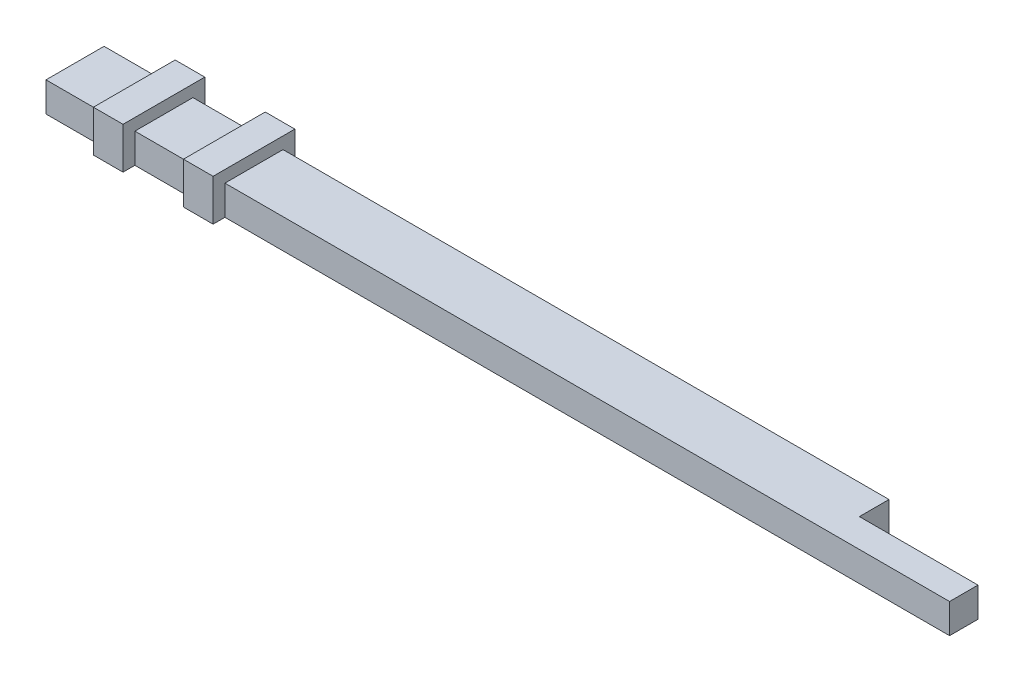
ISO-10303-21;
HEADER;
FILE_DESCRIPTION(('STEP AP214'),'2;1');
FILE_NAME('part.step','',(''),(''),'','','');
FILE_SCHEMA(('AUTOMOTIVE_DESIGN { 1 0 10303 214 1 1 1 1 }'));
ENDSEC;
DATA;
#1=APPLICATION_CONTEXT('core data for automotive mechanical design processes');
#2=APPLICATION_PROTOCOL_DEFINITION('international standard','automotive_design',2000,#1);
#3=PRODUCT_CONTEXT('',#1,'mechanical');
#4=PRODUCT('Part','Part','',(#3));
#5=PRODUCT_RELATED_PRODUCT_CATEGORY('part','',(#4));
#6=PRODUCT_DEFINITION_FORMATION('','',#4);
#7=PRODUCT_DEFINITION_CONTEXT('part definition',#1,'design');
#8=PRODUCT_DEFINITION('design','',#6,#7);
#9=PRODUCT_DEFINITION_SHAPE('','',#8);
#10=(LENGTH_UNIT() NAMED_UNIT(*) SI_UNIT(.MILLI.,.METRE.));
#11=(NAMED_UNIT(*) PLANE_ANGLE_UNIT() SI_UNIT($,.RADIAN.));
#12=(NAMED_UNIT(*) SI_UNIT($,.STERADIAN.) SOLID_ANGLE_UNIT());
#13=UNCERTAINTY_MEASURE_WITH_UNIT(LENGTH_MEASURE(1.E-05),#10,'distance_accuracy_value','');
#14=(GEOMETRIC_REPRESENTATION_CONTEXT(3) GLOBAL_UNCERTAINTY_ASSIGNED_CONTEXT((#13)) GLOBAL_UNIT_ASSIGNED_CONTEXT((#10,
#11,#12)) REPRESENTATION_CONTEXT('',''));
#15=CARTESIAN_POINT('',(0.,0.,0.));
#16=DIRECTION('',(0.,0.,1.));
#17=DIRECTION('',(1.,0.,0.));
#18=AXIS2_PLACEMENT_3D('',#15,#16,#17);
#19=CARTESIAN_POINT('',(142.5,5.,0.));
#20=DIRECTION('',(0.,0.,-1.));
#21=DIRECTION('',(-1.,0.,0.));
#22=AXIS2_PLACEMENT_3D('',#19,#20,#21);
#23=PLANE('',#22);
#24=DIRECTION('',(0.,-1.,0.));
#25=VECTOR('',#24,1.);
#26=CARTESIAN_POINT('',(25.2,5.,0.));
#27=LINE('',#26,#25);
#28=CARTESIAN_POINT('',(25.2,5.,0.));
#29=VERTEX_POINT('',#28);
#30=CARTESIAN_POINT('',(25.2,0.,0.));
#31=VERTEX_POINT('',#30);
#32=EDGE_CURVE('E213',#29,#31,#27,.T.);
#33=ORIENTED_EDGE('',*,*,#32,.F.);
#34=DIRECTION('',(1.,0.,0.));
#35=VECTOR('',#34,1.);
#36=CARTESIAN_POINT('',(0.,5.,0.));
#37=LINE('',#36,#35);
#38=CARTESIAN_POINT('',(15.,5.,0.));
#39=VERTEX_POINT('',#38);
#40=EDGE_CURVE('E308',#39,#29,#37,.T.);
#41=ORIENTED_EDGE('',*,*,#40,.F.);
#42=DIRECTION('',(0.,1.,0.));
#43=VECTOR('',#42,1.);
#44=CARTESIAN_POINT('',(15.,5.,0.));
#45=LINE('',#44,#43);
#46=CARTESIAN_POINT('',(15.,0.,0.));
#47=VERTEX_POINT('',#46);
#48=EDGE_CURVE('E296',#47,#39,#45,.T.);
#49=ORIENTED_EDGE('',*,*,#48,.F.);
#50=DIRECTION('',(1.,0.,0.));
#51=VECTOR('',#50,1.);
#52=CARTESIAN_POINT('',(142.5,0.,0.));
#53=LINE('',#52,#51);
#54=EDGE_CURVE('E327',#47,#31,#53,.T.);
#55=ORIENTED_EDGE('',*,*,#54,.T.);
#56=EDGE_LOOP('',(#33,#41,#49,#55));
#57=FACE_BOUND('',#56,.T.);
#58=ADVANCED_FACE('F42',(#57),#23,.F.);
#59=CARTESIAN_POINT('',(0.,5.,-9.8));
#60=DIRECTION('',(0.,0.,1.));
#61=DIRECTION('',(1.,0.,0.));
#62=AXIS2_PLACEMENT_3D('',#59,#60,#61);
#63=PLANE('',#62);
#64=DIRECTION('',(0.,1.,0.));
#65=VECTOR('',#64,1.);
#66=CARTESIAN_POINT('',(25.2,5.,-9.8));
#67=LINE('',#66,#65);
#68=CARTESIAN_POINT('',(25.2,0.,-9.8));
#69=VERTEX_POINT('',#68);
#70=CARTESIAN_POINT('',(25.2,5.,-9.8));
#71=VERTEX_POINT('',#70);
#72=EDGE_CURVE('E247',#69,#71,#67,.T.);
#73=ORIENTED_EDGE('',*,*,#72,.F.);
#74=DIRECTION('',(-1.,0.,0.));
#75=VECTOR('',#74,1.);
#76=CARTESIAN_POINT('',(0.,0.,-9.8));
#77=LINE('',#76,#75);
#78=CARTESIAN_POINT('',(15.,0.,-9.8));
#79=VERTEX_POINT('',#78);
#80=EDGE_CURVE('E337',#69,#79,#77,.T.);
#81=ORIENTED_EDGE('',*,*,#80,.T.);
#82=DIRECTION('',(0.,-1.,0.));
#83=VECTOR('',#82,1.);
#84=CARTESIAN_POINT('',(15.,5.,-9.8));
#85=LINE('',#84,#83);
#86=CARTESIAN_POINT('',(15.,5.,-9.8));
#87=VERTEX_POINT('',#86);
#88=EDGE_CURVE('E293',#87,#79,#85,.T.);
#89=ORIENTED_EDGE('',*,*,#88,.F.);
#90=DIRECTION('',(-1.,0.,0.));
#91=VECTOR('',#90,1.);
#92=CARTESIAN_POINT('',(0.,5.,-9.8));
#93=LINE('',#92,#91);
#94=EDGE_CURVE('E319',#71,#87,#93,.T.);
#95=ORIENTED_EDGE('',*,*,#94,.F.);
#96=EDGE_LOOP('',(#73,#81,#89,#95));
#97=FACE_BOUND('',#96,.T.);
#98=ADVANCED_FACE('F390',(#97),#63,.F.);
#99=CARTESIAN_POINT('',(0.,5.,0.));
#100=DIRECTION('',(0.,-1.,0.));
#101=DIRECTION('',(0.,0.,-1.));
#102=AXIS2_PLACEMENT_3D('',#99,#100,#101);
#103=PLANE('',#102);
#104=DIRECTION('',(0.,0.,1.));
#105=VECTOR('',#104,1.);
#106=CARTESIAN_POINT('',(25.2,5.,0.));
#107=LINE('',#106,#105);
#108=EDGE_CURVE('E245',#71,#29,#107,.T.);
#109=ORIENTED_EDGE('',*,*,#108,.F.);
#110=ORIENTED_EDGE('',*,*,#94,.T.);
#111=DIRECTION('',(0.,0.,-1.));
#112=VECTOR('',#111,1.);
#113=CARTESIAN_POINT('',(15.,5.,0.));
#114=LINE('',#113,#112);
#115=EDGE_CURVE('E290',#39,#87,#114,.T.);
#116=ORIENTED_EDGE('',*,*,#115,.F.);
#117=ORIENTED_EDGE('',*,*,#40,.T.);
#118=EDGE_LOOP('',(#109,#110,#116,#117));
#119=FACE_BOUND('',#118,.T.);
#120=ADVANCED_FACE('F375',(#119),#103,.F.);
#121=CARTESIAN_POINT('',(30.2,5.,0.));
#122=VERTEX_POINT('',#121);
#123=CARTESIAN_POINT('',(152.5,5.,0.));
#124=VERTEX_POINT('',#123);
#125=EDGE_CURVE('E302',#122,#124,#37,.T.);
#126=ORIENTED_EDGE('',*,*,#125,.F.);
#127=DIRECTION('',(0.,-1.,0.));
#128=VECTOR('',#127,1.);
#129=CARTESIAN_POINT('',(30.2,5.,0.));
#130=LINE('',#129,#128);
#131=CARTESIAN_POINT('',(30.2,0.,0.));
#132=VERTEX_POINT('',#131);
#133=EDGE_CURVE('E57',#122,#132,#130,.T.);
#134=ORIENTED_EDGE('',*,*,#133,.T.);
#135=CARTESIAN_POINT('',(152.5,0.,0.));
#136=VERTEX_POINT('',#135);
#137=EDGE_CURVE('E322',#132,#136,#53,.T.);
#138=ORIENTED_EDGE('',*,*,#137,.T.);
#139=DIRECTION('',(0.,-1.,0.));
#140=VECTOR('',#139,1.);
#141=CARTESIAN_POINT('',(152.5,5.,0.));
#142=LINE('',#141,#140);
#143=EDGE_CURVE('E50',#124,#136,#142,.T.);
#144=ORIENTED_EDGE('',*,*,#143,.F.);
#145=EDGE_LOOP('',(#126,#134,#138,#144));
#146=FACE_BOUND('',#145,.T.);
#147=ADVANCED_FACE('F379',(#146),#23,.F.);
#148=CARTESIAN_POINT('',(132.481495241722,0.,-9.8));
#149=VERTEX_POINT('',#148);
#150=CARTESIAN_POINT('',(30.2,0.,-9.8));
#151=VERTEX_POINT('',#150);
#152=EDGE_CURVE('E303',#149,#151,#77,.T.);
#153=ORIENTED_EDGE('',*,*,#152,.T.);
#154=DIRECTION('',(0.,1.,0.));
#155=VECTOR('',#154,1.);
#156=CARTESIAN_POINT('',(30.2,5.,-9.8));
#157=LINE('',#156,#155);
#158=CARTESIAN_POINT('',(30.2,5.,-9.8));
#159=VERTEX_POINT('',#158);
#160=EDGE_CURVE('E241',#151,#159,#157,.T.);
#161=ORIENTED_EDGE('',*,*,#160,.T.);
#162=CARTESIAN_POINT('',(132.481495241722,5.,-9.8));
#163=VERTEX_POINT('',#162);
#164=EDGE_CURVE('E315',#163,#159,#93,.T.);
#165=ORIENTED_EDGE('',*,*,#164,.F.);
#166=DIRECTION('',(0.,-1.,0.));
#167=VECTOR('',#166,1.);
#168=CARTESIAN_POINT('',(132.481495241722,5.,-9.8));
#169=LINE('',#168,#167);
#170=EDGE_CURVE('E340',#163,#149,#169,.T.);
#171=ORIENTED_EDGE('',*,*,#170,.T.);
#172=EDGE_LOOP('',(#153,#161,#165,#171));
#173=FACE_BOUND('',#172,.T.);
#174=ADVANCED_FACE('F381',(#173),#63,.F.);
#175=ORIENTED_EDGE('',*,*,#164,.T.);
#176=DIRECTION('',(0.,0.,1.));
#177=VECTOR('',#176,1.);
#178=CARTESIAN_POINT('',(30.2,5.,0.));
#179=LINE('',#178,#177);
#180=EDGE_CURVE('E235',#159,#122,#179,.T.);
#181=ORIENTED_EDGE('',*,*,#180,.T.);
#182=ORIENTED_EDGE('',*,*,#125,.T.);
#183=DIRECTION('',(0.,0.,-1.));
#184=VECTOR('',#183,1.);
#185=CARTESIAN_POINT('',(152.5,5.,0.));
#186=LINE('',#185,#184);
#187=CARTESIAN_POINT('',(152.5,5.,-4.8));
#188=VERTEX_POINT('',#187);
#189=EDGE_CURVE('E307',#124,#188,#186,.T.);
#190=ORIENTED_EDGE('',*,*,#189,.T.);
#191=DIRECTION('',(-1.,0.,0.));
#192=VECTOR('',#191,1.);
#193=CARTESIAN_POINT('',(142.481495241722,5.,-4.8));
#194=LINE('',#193,#192);
#195=CARTESIAN_POINT('',(132.481495241722,5.,-4.8));
#196=VERTEX_POINT('',#195);
#197=EDGE_CURVE('E310',#188,#196,#194,.T.);
#198=ORIENTED_EDGE('',*,*,#197,.T.);
#199=DIRECTION('',(0.,0.,-1.));
#200=VECTOR('',#199,1.);
#201=CARTESIAN_POINT('',(132.481495241722,5.,-9.8));
#202=LINE('',#201,#200);
#203=EDGE_CURVE('E312',#196,#163,#202,.T.);
#204=ORIENTED_EDGE('',*,*,#203,.T.);
#205=EDGE_LOOP('',(#175,#181,#182,#190,#198,#204));
#206=FACE_BOUND('',#205,.T.);
#207=ADVANCED_FACE('F369',(#206),#103,.F.);
#208=CARTESIAN_POINT('',(0.,5.,0.));
#209=DIRECTION('',(1.,0.,0.));
#210=DIRECTION('',(0.,0.,-1.));
#211=AXIS2_PLACEMENT_3D('',#208,#209,#210);
#212=PLANE('',#211);
#213=DIRECTION('',(0.,0.,1.));
#214=VECTOR('',#213,1.);
#215=CARTESIAN_POINT('',(0.,0.,0.));
#216=LINE('',#215,#214);
#217=CARTESIAN_POINT('',(0.,0.,-9.8));
#218=VERTEX_POINT('',#217);
#219=CARTESIAN_POINT('',(0.,0.,0.));
#220=VERTEX_POINT('',#219);
#221=EDGE_CURVE('E298',#218,#220,#216,.T.);
#222=ORIENTED_EDGE('',*,*,#221,.T.);
#223=DIRECTION('',(0.,-1.,0.));
#224=VECTOR('',#223,1.);
#225=CARTESIAN_POINT('',(0.,5.,0.));
#226=LINE('',#225,#224);
#227=CARTESIAN_POINT('',(0.,5.,0.));
#228=VERTEX_POINT('',#227);
#229=EDGE_CURVE('E11',#228,#220,#226,.T.);
#230=ORIENTED_EDGE('',*,*,#229,.F.);
#231=DIRECTION('',(0.,0.,1.));
#232=VECTOR('',#231,1.);
#233=CARTESIAN_POINT('',(0.,5.,0.));
#234=LINE('',#233,#232);
#235=CARTESIAN_POINT('',(0.,5.,-9.8));
#236=VERTEX_POINT('',#235);
#237=EDGE_CURVE('E299',#236,#228,#234,.T.);
#238=ORIENTED_EDGE('',*,*,#237,.F.);
#239=DIRECTION('',(0.,-1.,0.));
#240=VECTOR('',#239,1.);
#241=CARTESIAN_POINT('',(0.,5.,-9.8));
#242=LINE('',#241,#240);
#243=EDGE_CURVE('E318',#236,#218,#242,.T.);
#244=ORIENTED_EDGE('',*,*,#243,.T.);
#245=EDGE_LOOP('',(#222,#230,#238,#244));
#246=FACE_BOUND('',#245,.T.);
#247=ADVANCED_FACE('F44',(#246),#212,.F.);
#248=CARTESIAN_POINT('',(10.,0.,0.));
#249=VERTEX_POINT('',#248);
#250=EDGE_CURVE('E323',#220,#249,#53,.T.);
#251=ORIENTED_EDGE('',*,*,#250,.T.);
#252=DIRECTION('',(0.,1.,0.));
#253=VECTOR('',#252,1.);
#254=CARTESIAN_POINT('',(10.,5.,0.));
#255=LINE('',#254,#253);
#256=CARTESIAN_POINT('',(10.,5.,0.));
#257=VERTEX_POINT('',#256);
#258=EDGE_CURVE('E287',#249,#257,#255,.T.);
#259=ORIENTED_EDGE('',*,*,#258,.T.);
#260=EDGE_CURVE('E304',#228,#257,#37,.T.);
#261=ORIENTED_EDGE('',*,*,#260,.F.);
#262=ORIENTED_EDGE('',*,*,#229,.T.);
#263=EDGE_LOOP('',(#251,#259,#261,#262));
#264=FACE_BOUND('',#263,.T.);
#265=ADVANCED_FACE('F382',(#264),#23,.F.);
#266=CARTESIAN_POINT('',(152.5,5.,0.));
#267=DIRECTION('',(-1.,0.,0.));
#268=DIRECTION('',(0.,0.,1.));
#269=AXIS2_PLACEMENT_3D('',#266,#267,#268);
#270=PLANE('',#269);
#271=DIRECTION('',(0.,0.,-1.));
#272=VECTOR('',#271,1.);
#273=CARTESIAN_POINT('',(152.5,0.,0.));
#274=LINE('',#273,#272);
#275=CARTESIAN_POINT('',(152.5,0.,-4.8));
#276=VERTEX_POINT('',#275);
#277=EDGE_CURVE('E326',#136,#276,#274,.T.);
#278=ORIENTED_EDGE('',*,*,#277,.T.);
#279=DIRECTION('',(0.,-1.,0.));
#280=VECTOR('',#279,1.);
#281=CARTESIAN_POINT('',(152.5,5.,-4.8));
#282=LINE('',#281,#280);
#283=EDGE_CURVE('E346',#188,#276,#282,.T.);
#284=ORIENTED_EDGE('',*,*,#283,.F.);
#285=ORIENTED_EDGE('',*,*,#189,.F.);
#286=ORIENTED_EDGE('',*,*,#143,.T.);
#287=EDGE_LOOP('',(#278,#284,#285,#286));
#288=FACE_BOUND('',#287,.T.);
#289=ADVANCED_FACE('F353',(#288),#270,.F.);
#290=CARTESIAN_POINT('',(132.481495241722,5.,-4.8));
#291=DIRECTION('',(0.,0.,1.));
#292=DIRECTION('',(1.,0.,0.));
#293=AXIS2_PLACEMENT_3D('',#290,#291,#292);
#294=PLANE('',#293);
#295=DIRECTION('',(-1.,0.,0.));
#296=VECTOR('',#295,1.);
#297=CARTESIAN_POINT('',(132.481495241722,0.,-4.8));
#298=LINE('',#297,#296);
#299=CARTESIAN_POINT('',(132.481495241722,0.,-4.8));
#300=VERTEX_POINT('',#299);
#301=EDGE_CURVE('E330',#276,#300,#298,.T.);
#302=ORIENTED_EDGE('',*,*,#301,.T.);
#303=DIRECTION('',(0.,-1.,0.));
#304=VECTOR('',#303,1.);
#305=CARTESIAN_POINT('',(132.481495241722,5.,-4.8));
#306=LINE('',#305,#304);
#307=EDGE_CURVE('E343',#196,#300,#306,.T.);
#308=ORIENTED_EDGE('',*,*,#307,.F.);
#309=ORIENTED_EDGE('',*,*,#197,.F.);
#310=ORIENTED_EDGE('',*,*,#283,.T.);
#311=EDGE_LOOP('',(#302,#308,#309,#310));
#312=FACE_BOUND('',#311,.T.);
#313=ADVANCED_FACE('F361',(#312),#294,.F.);
#314=CARTESIAN_POINT('',(132.481495241722,5.,-9.8));
#315=DIRECTION('',(-1.,0.,0.));
#316=DIRECTION('',(0.,0.,1.));
#317=AXIS2_PLACEMENT_3D('',#314,#315,#316);
#318=PLANE('',#317);
#319=DIRECTION('',(0.,0.,-1.));
#320=VECTOR('',#319,1.);
#321=CARTESIAN_POINT('',(132.481495241722,0.,-9.8));
#322=LINE('',#321,#320);
#323=EDGE_CURVE('E332',#300,#149,#322,.T.);
#324=ORIENTED_EDGE('',*,*,#323,.T.);
#325=ORIENTED_EDGE('',*,*,#170,.F.);
#326=ORIENTED_EDGE('',*,*,#203,.F.);
#327=ORIENTED_EDGE('',*,*,#307,.T.);
#328=EDGE_LOOP('',(#324,#325,#326,#327));
#329=FACE_BOUND('',#328,.T.);
#330=ADVANCED_FACE('F365',(#329),#318,.F.);
#331=CARTESIAN_POINT('',(10.,5.,-9.8));
#332=VERTEX_POINT('',#331);
#333=EDGE_CURVE('E314',#332,#236,#93,.T.);
#334=ORIENTED_EDGE('',*,*,#333,.F.);
#335=DIRECTION('',(0.,-1.,0.));
#336=VECTOR('',#335,1.);
#337=CARTESIAN_POINT('',(10.,5.,-9.8));
#338=LINE('',#337,#336);
#339=CARTESIAN_POINT('',(10.,0.,-9.8));
#340=VERTEX_POINT('',#339);
#341=EDGE_CURVE('E65',#332,#340,#338,.T.);
#342=ORIENTED_EDGE('',*,*,#341,.T.);
#343=EDGE_CURVE('E334',#340,#218,#77,.T.);
#344=ORIENTED_EDGE('',*,*,#343,.T.);
#345=ORIENTED_EDGE('',*,*,#243,.F.);
#346=EDGE_LOOP('',(#334,#342,#344,#345));
#347=FACE_BOUND('',#346,.T.);
#348=ADVANCED_FACE('F389',(#347),#63,.F.);
#349=ORIENTED_EDGE('',*,*,#260,.T.);
#350=DIRECTION('',(0.,0.,-1.));
#351=VECTOR('',#350,1.);
#352=CARTESIAN_POINT('',(10.,5.,0.));
#353=LINE('',#352,#351);
#354=EDGE_CURVE('E278',#257,#332,#353,.T.);
#355=ORIENTED_EDGE('',*,*,#354,.T.);
#356=ORIENTED_EDGE('',*,*,#333,.T.);
#357=ORIENTED_EDGE('',*,*,#237,.T.);
#358=EDGE_LOOP('',(#349,#355,#356,#357));
#359=FACE_BOUND('',#358,.T.);
#360=ADVANCED_FACE('F392',(#359),#103,.F.);
#361=CARTESIAN_POINT('',(0.,0.,0.));
#362=DIRECTION('',(0.,-1.,0.));
#363=DIRECTION('',(0.,0.,-1.));
#364=AXIS2_PLACEMENT_3D('',#361,#362,#363);
#365=PLANE('',#364);
#366=ORIENTED_EDGE('',*,*,#137,.F.);
#367=DIRECTION('',(0.,0.,-1.));
#368=VECTOR('',#367,1.);
#369=CARTESIAN_POINT('',(30.2,0.,2.));
#370=LINE('',#369,#368);
#371=CARTESIAN_POINT('',(30.2,0.,2.));
#372=VERTEX_POINT('',#371);
#373=EDGE_CURVE('E198',#372,#132,#370,.T.);
#374=ORIENTED_EDGE('',*,*,#373,.F.);
#375=DIRECTION('',(1.,0.,0.));
#376=VECTOR('',#375,1.);
#377=CARTESIAN_POINT('',(25.2,0.,2.));
#378=LINE('',#377,#376);
#379=CARTESIAN_POINT('',(25.2,0.,2.));
#380=VERTEX_POINT('',#379);
#381=EDGE_CURVE('E191',#380,#372,#378,.T.);
#382=ORIENTED_EDGE('',*,*,#381,.F.);
#383=DIRECTION('',(0.,0.,-1.));
#384=VECTOR('',#383,1.);
#385=CARTESIAN_POINT('',(25.2,0.,2.));
#386=LINE('',#385,#384);
#387=EDGE_CURVE('E196',#380,#31,#386,.T.);
#388=ORIENTED_EDGE('',*,*,#387,.T.);
#389=ORIENTED_EDGE('',*,*,#54,.F.);
#390=DIRECTION('',(0.,0.,1.));
#391=VECTOR('',#390,1.);
#392=CARTESIAN_POINT('',(15.,0.,-11.8));
#393=LINE('',#392,#391);
#394=CARTESIAN_POINT('',(15.,0.,2.));
#395=VERTEX_POINT('',#394);
#396=EDGE_CURVE('E254',#47,#395,#393,.T.);
#397=ORIENTED_EDGE('',*,*,#396,.T.);
#398=DIRECTION('',(-1.,0.,0.));
#399=VECTOR('',#398,1.);
#400=CARTESIAN_POINT('',(15.,0.,2.));
#401=LINE('',#400,#399);
#402=CARTESIAN_POINT('',(10.,0.,2.));
#403=VERTEX_POINT('',#402);
#404=EDGE_CURVE('E281',#395,#403,#401,.T.);
#405=ORIENTED_EDGE('',*,*,#404,.T.);
#406=DIRECTION('',(0.,0.,1.));
#407=VECTOR('',#406,1.);
#408=CARTESIAN_POINT('',(10.,0.,-11.8));
#409=LINE('',#408,#407);
#410=EDGE_CURVE('E268',#249,#403,#409,.T.);
#411=ORIENTED_EDGE('',*,*,#410,.F.);
#412=ORIENTED_EDGE('',*,*,#250,.F.);
#413=ORIENTED_EDGE('',*,*,#221,.F.);
#414=ORIENTED_EDGE('',*,*,#343,.F.);
#415=CARTESIAN_POINT('',(10.,0.,-11.8));
#416=VERTEX_POINT('',#415);
#417=EDGE_CURVE('E269',#416,#340,#409,.T.);
#418=ORIENTED_EDGE('',*,*,#417,.F.);
#419=DIRECTION('',(-1.,0.,0.));
#420=VECTOR('',#419,1.);
#421=CARTESIAN_POINT('',(15.,0.,-11.8));
#422=LINE('',#421,#420);
#423=CARTESIAN_POINT('',(15.,0.,-11.8));
#424=VERTEX_POINT('',#423);
#425=EDGE_CURVE('E265',#424,#416,#422,.T.);
#426=ORIENTED_EDGE('',*,*,#425,.F.);
#427=EDGE_CURVE('E256',#424,#79,#393,.T.);
#428=ORIENTED_EDGE('',*,*,#427,.T.);
#429=ORIENTED_EDGE('',*,*,#80,.F.);
#430=CARTESIAN_POINT('',(25.2,0.,-11.8));
#431=VERTEX_POINT('',#430);
#432=EDGE_CURVE('E215',#69,#431,#386,.T.);
#433=ORIENTED_EDGE('',*,*,#432,.T.);
#434=DIRECTION('',(1.,0.,0.));
#435=VECTOR('',#434,1.);
#436=CARTESIAN_POINT('',(25.2,0.,-11.8));
#437=LINE('',#436,#435);
#438=CARTESIAN_POINT('',(30.2,0.,-11.8));
#439=VERTEX_POINT('',#438);
#440=EDGE_CURVE('E203',#431,#439,#437,.T.);
#441=ORIENTED_EDGE('',*,*,#440,.T.);
#442=EDGE_CURVE('E230',#151,#439,#370,.T.);
#443=ORIENTED_EDGE('',*,*,#442,.F.);
#444=ORIENTED_EDGE('',*,*,#152,.F.);
#445=ORIENTED_EDGE('',*,*,#323,.F.);
#446=ORIENTED_EDGE('',*,*,#301,.F.);
#447=ORIENTED_EDGE('',*,*,#277,.F.);
#448=EDGE_LOOP('',(#366,#374,#382,#388,#389,#397,#405,#411,#412,#413,#414,#418,#426,#428,#429,
#433,#441,#443,#444,#445,#446,#447));
#449=FACE_BOUND('',#448,.T.);
#450=ADVANCED_FACE('F194',(#449),#365,.T.);
#451=CARTESIAN_POINT('',(15.,0.,0.));
#452=DIRECTION('',(-1.,0.,0.));
#453=DIRECTION('',(0.,0.,1.));
#454=AXIS2_PLACEMENT_3D('',#451,#452,#453);
#455=PLANE('',#454);
#456=ORIENTED_EDGE('',*,*,#396,.F.);
#457=ORIENTED_EDGE('',*,*,#48,.T.);
#458=ORIENTED_EDGE('',*,*,#115,.T.);
#459=ORIENTED_EDGE('',*,*,#88,.T.);
#460=ORIENTED_EDGE('',*,*,#427,.F.);
#461=DIRECTION('',(0.,-1.,0.));
#462=VECTOR('',#461,1.);
#463=CARTESIAN_POINT('',(15.,7.,-11.8));
#464=LINE('',#463,#462);
#465=CARTESIAN_POINT('',(15.,7.,-11.8));
#466=VERTEX_POINT('',#465);
#467=EDGE_CURVE('E251',#466,#424,#464,.T.);
#468=ORIENTED_EDGE('',*,*,#467,.F.);
#469=DIRECTION('',(0.,0.,-1.));
#470=VECTOR('',#469,1.);
#471=CARTESIAN_POINT('',(15.,7.,-11.8));
#472=LINE('',#471,#470);
#473=CARTESIAN_POINT('',(15.,7.,2.));
#474=VERTEX_POINT('',#473);
#475=EDGE_CURVE('E262',#474,#466,#472,.T.);
#476=ORIENTED_EDGE('',*,*,#475,.F.);
#477=DIRECTION('',(0.,1.,0.));
#478=VECTOR('',#477,1.);
#479=CARTESIAN_POINT('',(15.,7.,2.));
#480=LINE('',#479,#478);
#481=EDGE_CURVE('E259',#395,#474,#480,.T.);
#482=ORIENTED_EDGE('',*,*,#481,.F.);
#483=EDGE_LOOP('',(#456,#457,#458,#459,#460,#468,#476,#482));
#484=FACE_BOUND('',#483,.T.);
#485=ADVANCED_FACE('F420',(#484),#455,.F.);
#486=CARTESIAN_POINT('',(10.,0.,0.));
#487=DIRECTION('',(-1.,0.,0.));
#488=DIRECTION('',(0.,0.,1.));
#489=AXIS2_PLACEMENT_3D('',#486,#487,#488);
#490=PLANE('',#489);
#491=ORIENTED_EDGE('',*,*,#258,.F.);
#492=ORIENTED_EDGE('',*,*,#410,.T.);
#493=DIRECTION('',(0.,1.,0.));
#494=VECTOR('',#493,1.);
#495=CARTESIAN_POINT('',(10.,7.,2.));
#496=LINE('',#495,#494);
#497=CARTESIAN_POINT('',(10.,7.,2.));
#498=VERTEX_POINT('',#497);
#499=EDGE_CURVE('E271',#403,#498,#496,.T.);
#500=ORIENTED_EDGE('',*,*,#499,.T.);
#501=DIRECTION('',(0.,0.,-1.));
#502=VECTOR('',#501,1.);
#503=CARTESIAN_POINT('',(10.,7.,-11.8));
#504=LINE('',#503,#502);
#505=CARTESIAN_POINT('',(10.,7.,-11.8));
#506=VERTEX_POINT('',#505);
#507=EDGE_CURVE('E255',#498,#506,#504,.T.);
#508=ORIENTED_EDGE('',*,*,#507,.T.);
#509=DIRECTION('',(0.,-1.,0.));
#510=VECTOR('',#509,1.);
#511=CARTESIAN_POINT('',(10.,7.,-11.8));
#512=LINE('',#511,#510);
#513=EDGE_CURVE('E250',#506,#416,#512,.T.);
#514=ORIENTED_EDGE('',*,*,#513,.T.);
#515=ORIENTED_EDGE('',*,*,#417,.T.);
#516=ORIENTED_EDGE('',*,*,#341,.F.);
#517=ORIENTED_EDGE('',*,*,#354,.F.);
#518=EDGE_LOOP('',(#491,#492,#500,#508,#514,#515,#516,#517));
#519=FACE_BOUND('',#518,.T.);
#520=ADVANCED_FACE('F428',(#519),#490,.T.);
#521=CARTESIAN_POINT('',(15.,7.,-11.8));
#522=DIRECTION('',(0.,0.,-1.));
#523=DIRECTION('',(-1.,0.,0.));
#524=AXIS2_PLACEMENT_3D('',#521,#522,#523);
#525=PLANE('',#524);
#526=ORIENTED_EDGE('',*,*,#513,.F.);
#527=DIRECTION('',(-1.,0.,0.));
#528=VECTOR('',#527,1.);
#529=CARTESIAN_POINT('',(15.,7.,-11.8));
#530=LINE('',#529,#528);
#531=EDGE_CURVE('E276',#466,#506,#530,.T.);
#532=ORIENTED_EDGE('',*,*,#531,.F.);
#533=ORIENTED_EDGE('',*,*,#467,.T.);
#534=ORIENTED_EDGE('',*,*,#425,.T.);
#535=EDGE_LOOP('',(#526,#532,#533,#534));
#536=FACE_BOUND('',#535,.T.);
#537=ADVANCED_FACE('F440',(#536),#525,.T.);
#538=CARTESIAN_POINT('',(15.,7.,-11.8));
#539=DIRECTION('',(0.,1.,0.));
#540=DIRECTION('',(0.,0.,1.));
#541=AXIS2_PLACEMENT_3D('',#538,#539,#540);
#542=PLANE('',#541);
#543=ORIENTED_EDGE('',*,*,#507,.F.);
#544=DIRECTION('',(-1.,0.,0.));
#545=VECTOR('',#544,1.);
#546=CARTESIAN_POINT('',(15.,7.,2.));
#547=LINE('',#546,#545);
#548=EDGE_CURVE('E279',#474,#498,#547,.T.);
#549=ORIENTED_EDGE('',*,*,#548,.F.);
#550=ORIENTED_EDGE('',*,*,#475,.T.);
#551=ORIENTED_EDGE('',*,*,#531,.T.);
#552=EDGE_LOOP('',(#543,#549,#550,#551));
#553=FACE_BOUND('',#552,.T.);
#554=ADVANCED_FACE('F437',(#553),#542,.T.);
#555=CARTESIAN_POINT('',(15.,7.,2.));
#556=DIRECTION('',(0.,0.,1.));
#557=DIRECTION('',(1.,0.,0.));
#558=AXIS2_PLACEMENT_3D('',#555,#556,#557);
#559=PLANE('',#558);
#560=ORIENTED_EDGE('',*,*,#499,.F.);
#561=ORIENTED_EDGE('',*,*,#404,.F.);
#562=ORIENTED_EDGE('',*,*,#481,.T.);
#563=ORIENTED_EDGE('',*,*,#548,.T.);
#564=EDGE_LOOP('',(#560,#561,#562,#563));
#565=FACE_BOUND('',#564,.T.);
#566=ADVANCED_FACE('F434',(#565),#559,.T.);
#567=CARTESIAN_POINT('',(25.2,0.,0.));
#568=DIRECTION('',(1.,0.,0.));
#569=DIRECTION('',(0.,0.,-1.));
#570=AXIS2_PLACEMENT_3D('',#567,#568,#569);
#571=PLANE('',#570);
#572=ORIENTED_EDGE('',*,*,#108,.T.);
#573=ORIENTED_EDGE('',*,*,#32,.T.);
#574=ORIENTED_EDGE('',*,*,#387,.F.);
#575=DIRECTION('',(0.,-1.,0.));
#576=VECTOR('',#575,1.);
#577=CARTESIAN_POINT('',(25.2,7.,2.));
#578=LINE('',#577,#576);
#579=CARTESIAN_POINT('',(25.2,7.,2.));
#580=VERTEX_POINT('',#579);
#581=EDGE_CURVE('E210',#580,#380,#578,.T.);
#582=ORIENTED_EDGE('',*,*,#581,.F.);
#583=DIRECTION('',(0.,0.,1.));
#584=VECTOR('',#583,1.);
#585=CARTESIAN_POINT('',(25.2,7.,2.));
#586=LINE('',#585,#584);
#587=CARTESIAN_POINT('',(25.2,7.,-11.8));
#588=VERTEX_POINT('',#587);
#589=EDGE_CURVE('E204',#588,#580,#586,.T.);
#590=ORIENTED_EDGE('',*,*,#589,.F.);
#591=DIRECTION('',(0.,1.,0.));
#592=VECTOR('',#591,1.);
#593=CARTESIAN_POINT('',(25.2,7.,-11.8));
#594=LINE('',#593,#592);
#595=EDGE_CURVE('E214',#431,#588,#594,.T.);
#596=ORIENTED_EDGE('',*,*,#595,.F.);
#597=ORIENTED_EDGE('',*,*,#432,.F.);
#598=ORIENTED_EDGE('',*,*,#72,.T.);
#599=EDGE_LOOP('',(#572,#573,#574,#582,#590,#596,#597,#598));
#600=FACE_BOUND('',#599,.T.);
#601=ADVANCED_FACE('F208',(#600),#571,.F.);
#602=CARTESIAN_POINT('',(30.2,0.,0.));
#603=DIRECTION('',(1.,0.,0.));
#604=DIRECTION('',(0.,0.,-1.));
#605=AXIS2_PLACEMENT_3D('',#602,#603,#604);
#606=PLANE('',#605);
#607=ORIENTED_EDGE('',*,*,#133,.F.);
#608=ORIENTED_EDGE('',*,*,#180,.F.);
#609=ORIENTED_EDGE('',*,*,#160,.F.);
#610=ORIENTED_EDGE('',*,*,#442,.T.);
#611=DIRECTION('',(0.,1.,0.));
#612=VECTOR('',#611,1.);
#613=CARTESIAN_POINT('',(30.2,7.,-11.8));
#614=LINE('',#613,#612);
#615=CARTESIAN_POINT('',(30.2,7.,-11.8));
#616=VERTEX_POINT('',#615);
#617=EDGE_CURVE('E222',#439,#616,#614,.T.);
#618=ORIENTED_EDGE('',*,*,#617,.T.);
#619=DIRECTION('',(0.,0.,1.));
#620=VECTOR('',#619,1.);
#621=CARTESIAN_POINT('',(30.2,7.,2.));
#622=LINE('',#621,#620);
#623=CARTESIAN_POINT('',(30.2,7.,2.));
#624=VERTEX_POINT('',#623);
#625=EDGE_CURVE('E219',#616,#624,#622,.T.);
#626=ORIENTED_EDGE('',*,*,#625,.T.);
#627=DIRECTION('',(0.,-1.,0.));
#628=VECTOR('',#627,1.);
#629=CARTESIAN_POINT('',(30.2,7.,2.));
#630=LINE('',#629,#628);
#631=EDGE_CURVE('E228',#624,#372,#630,.T.);
#632=ORIENTED_EDGE('',*,*,#631,.T.);
#633=ORIENTED_EDGE('',*,*,#373,.T.);
#634=EDGE_LOOP('',(#607,#608,#609,#610,#618,#626,#632,#633));
#635=FACE_BOUND('',#634,.T.);
#636=ADVANCED_FACE('F464',(#635),#606,.T.);
#637=CARTESIAN_POINT('',(25.2,7.,2.));
#638=DIRECTION('',(0.,0.,1.));
#639=DIRECTION('',(0.,-1.,0.));
#640=AXIS2_PLACEMENT_3D('',#637,#638,#639);
#641=PLANE('',#640);
#642=ORIENTED_EDGE('',*,*,#631,.F.);
#643=DIRECTION('',(1.,0.,0.));
#644=VECTOR('',#643,1.);
#645=CARTESIAN_POINT('',(25.2,7.,2.));
#646=LINE('',#645,#644);
#647=EDGE_CURVE('E218',#580,#624,#646,.T.);
#648=ORIENTED_EDGE('',*,*,#647,.F.);
#649=ORIENTED_EDGE('',*,*,#581,.T.);
#650=ORIENTED_EDGE('',*,*,#381,.T.);
#651=EDGE_LOOP('',(#642,#648,#649,#650));
#652=FACE_BOUND('',#651,.T.);
#653=ADVANCED_FACE('F217',(#652),#641,.T.);
#654=CARTESIAN_POINT('',(25.2,7.,2.));
#655=DIRECTION('',(0.,1.,0.));
#656=DIRECTION('',(0.,0.,1.));
#657=AXIS2_PLACEMENT_3D('',#654,#655,#656);
#658=PLANE('',#657);
#659=ORIENTED_EDGE('',*,*,#625,.F.);
#660=DIRECTION('',(1.,0.,0.));
#661=VECTOR('',#660,1.);
#662=CARTESIAN_POINT('',(25.2,7.,-11.8));
#663=LINE('',#662,#661);
#664=EDGE_CURVE('E236',#588,#616,#663,.T.);
#665=ORIENTED_EDGE('',*,*,#664,.F.);
#666=ORIENTED_EDGE('',*,*,#589,.T.);
#667=ORIENTED_EDGE('',*,*,#647,.T.);
#668=EDGE_LOOP('',(#659,#665,#666,#667));
#669=FACE_BOUND('',#668,.T.);
#670=ADVANCED_FACE('F463',(#669),#658,.T.);
#671=CARTESIAN_POINT('',(25.2,7.,-11.8));
#672=DIRECTION('',(0.,0.,-1.));
#673=DIRECTION('',(-1.,0.,0.));
#674=AXIS2_PLACEMENT_3D('',#671,#672,#673);
#675=PLANE('',#674);
#676=ORIENTED_EDGE('',*,*,#617,.F.);
#677=ORIENTED_EDGE('',*,*,#440,.F.);
#678=ORIENTED_EDGE('',*,*,#595,.T.);
#679=ORIENTED_EDGE('',*,*,#664,.T.);
#680=EDGE_LOOP('',(#676,#677,#678,#679));
#681=FACE_BOUND('',#680,.T.);
#682=ADVANCED_FACE('F465',(#681),#675,.T.);
#683=CLOSED_SHELL('',(#58,#98,#120,#147,#174,#207,#247,#265,#289,#313,#330,#348,#360,#450,#485,
#520,#537,#554,#566,#601,#636,#653,#670,#682));
#684=MANIFOLD_SOLID_BREP('B2',#683);
#685=ADVANCED_BREP_SHAPE_REPRESENTATION('',(#18,#684),#14);
#686=SHAPE_DEFINITION_REPRESENTATION(#9,#685);
ENDSEC;
END-ISO-10303-21;
